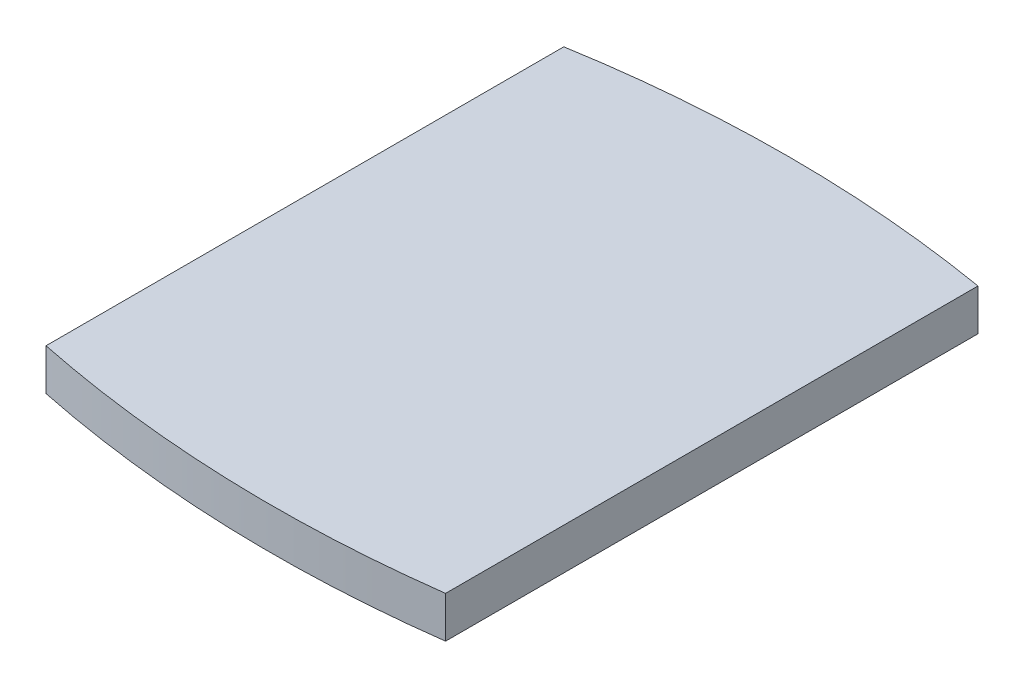
ISO-10303-21;
HEADER;
FILE_DESCRIPTION(('STEP AP214'),'2;1');
FILE_NAME('part.step','',(''),(''),'','','');
FILE_SCHEMA(('AUTOMOTIVE_DESIGN { 1 0 10303 214 1 1 1 1 }'));
ENDSEC;
DATA;
#1=APPLICATION_CONTEXT('core data for automotive mechanical design processes');
#2=APPLICATION_PROTOCOL_DEFINITION('international standard','automotive_design',2000,#1);
#3=PRODUCT_CONTEXT('',#1,'mechanical');
#4=PRODUCT('Part','Part','',(#3));
#5=PRODUCT_RELATED_PRODUCT_CATEGORY('part','',(#4));
#6=PRODUCT_DEFINITION_FORMATION('','',#4);
#7=PRODUCT_DEFINITION_CONTEXT('part definition',#1,'design');
#8=PRODUCT_DEFINITION('design','',#6,#7);
#9=PRODUCT_DEFINITION_SHAPE('','',#8);
#10=(LENGTH_UNIT() NAMED_UNIT(*) SI_UNIT(.MILLI.,.METRE.));
#11=(NAMED_UNIT(*) PLANE_ANGLE_UNIT() SI_UNIT($,.RADIAN.));
#12=(NAMED_UNIT(*) SI_UNIT($,.STERADIAN.) SOLID_ANGLE_UNIT());
#13=UNCERTAINTY_MEASURE_WITH_UNIT(LENGTH_MEASURE(1.E-05),#10,'distance_accuracy_value','');
#14=(GEOMETRIC_REPRESENTATION_CONTEXT(3) GLOBAL_UNCERTAINTY_ASSIGNED_CONTEXT((#13)) GLOBAL_UNIT_ASSIGNED_CONTEXT((#10,
#11,#12)) REPRESENTATION_CONTEXT('',''));
#15=CARTESIAN_POINT('',(0.,0.,0.));
#16=DIRECTION('',(0.,0.,1.));
#17=DIRECTION('',(1.,0.,0.));
#18=AXIS2_PLACEMENT_3D('',#15,#16,#17);
#19=CARTESIAN_POINT('',(12.0899913600632,2.,-58.7693126462578));
#20=DIRECTION('',(0.,-1.,0.));
#21=DIRECTION('',(0.,0.,-1.));
#22=AXIS2_PLACEMENT_3D('',#19,#20,#21);
#23=CYLINDRICAL_SURFACE('',#22,60.);
#24=CARTESIAN_POINT('',(12.0899913600632,0.,-58.7693126462578));
#25=DIRECTION('',(0.,1.,0.));
#26=DIRECTION('',(0.,0.,1.));
#27=AXIS2_PLACEMENT_3D('',#24,#25,#26);
#28=CIRCLE('',#27,60.);
#29=CARTESIAN_POINT('',(0.,0.,0.));
#30=VERTEX_POINT('',#29);
#31=CARTESIAN_POINT('',(20.,0.,0.706999977476057));
#32=VERTEX_POINT('',#31);
#33=EDGE_CURVE('E98',#30,#32,#28,.T.);
#34=ORIENTED_EDGE('',*,*,#33,.T.);
#35=DIRECTION('',(0.,-1.,0.));
#36=VECTOR('',#35,1.);
#37=CARTESIAN_POINT('',(20.,2.,0.706999977476057));
#38=LINE('',#37,#36);
#39=CARTESIAN_POINT('',(20.,2.,0.706999977476057));
#40=VERTEX_POINT('',#39);
#41=EDGE_CURVE('E11',#40,#32,#38,.T.);
#42=ORIENTED_EDGE('',*,*,#41,.F.);
#43=CARTESIAN_POINT('',(12.0899913600632,2.,-58.7693126462578));
#44=DIRECTION('',(0.,1.,0.));
#45=DIRECTION('',(0.,0.,1.));
#46=AXIS2_PLACEMENT_3D('',#43,#44,#45);
#47=CIRCLE('',#46,60.);
#48=CARTESIAN_POINT('',(0.,2.,0.));
#49=VERTEX_POINT('',#48);
#50=EDGE_CURVE('E86',#49,#40,#47,.T.);
#51=ORIENTED_EDGE('',*,*,#50,.F.);
#52=DIRECTION('',(0.,-1.,0.));
#53=VECTOR('',#52,1.);
#54=CARTESIAN_POINT('',(0.,2.,0.));
#55=LINE('',#54,#53);
#56=EDGE_CURVE('E94',#49,#30,#55,.T.);
#57=ORIENTED_EDGE('',*,*,#56,.T.);
#58=EDGE_LOOP('',(#34,#42,#51,#57));
#59=FACE_BOUND('',#58,.T.);
#60=ADVANCED_FACE('F35',(#59),#23,.T.);
#61=CARTESIAN_POINT('',(20.,2.,-25.));
#62=DIRECTION('',(-1.,0.,0.));
#63=DIRECTION('',(0.,0.,1.));
#64=AXIS2_PLACEMENT_3D('',#61,#62,#63);
#65=PLANE('',#64);
#66=DIRECTION('',(0.,0.,-1.));
#67=VECTOR('',#66,1.);
#68=CARTESIAN_POINT('',(20.,0.,-25.));
#69=LINE('',#68,#67);
#70=CARTESIAN_POINT('',(20.,0.,-25.));
#71=VERTEX_POINT('',#70);
#72=EDGE_CURVE('E90',#32,#71,#69,.T.);
#73=ORIENTED_EDGE('',*,*,#72,.T.);
#74=DIRECTION('',(0.,-1.,0.));
#75=VECTOR('',#74,1.);
#76=CARTESIAN_POINT('',(20.,2.,-25.));
#77=LINE('',#76,#75);
#78=CARTESIAN_POINT('',(20.,2.,-25.));
#79=VERTEX_POINT('',#78);
#80=EDGE_CURVE('E43',#79,#71,#77,.T.);
#81=ORIENTED_EDGE('',*,*,#80,.F.);
#82=DIRECTION('',(0.,0.,-1.));
#83=VECTOR('',#82,1.);
#84=CARTESIAN_POINT('',(20.,2.,-25.));
#85=LINE('',#84,#83);
#86=EDGE_CURVE('E81',#40,#79,#85,.T.);
#87=ORIENTED_EDGE('',*,*,#86,.F.);
#88=ORIENTED_EDGE('',*,*,#41,.T.);
#89=EDGE_LOOP('',(#73,#81,#87,#88));
#90=FACE_BOUND('',#89,.T.);
#91=ADVANCED_FACE('F89',(#90),#65,.F.);
#92=CARTESIAN_POINT('',(10.,2.,34.1607978309962));
#93=DIRECTION('',(0.,-1.,0.));
#94=DIRECTION('',(0.,0.,-1.));
#95=AXIS2_PLACEMENT_3D('',#92,#93,#94);
#96=CYLINDRICAL_SURFACE('',#95,60.);
#97=CARTESIAN_POINT('',(10.,0.,34.1607978309962));
#98=DIRECTION('',(0.,1.,0.));
#99=DIRECTION('',(0.,0.,-1.));
#100=AXIS2_PLACEMENT_3D('',#97,#98,#99);
#101=CIRCLE('',#100,60.);
#102=CARTESIAN_POINT('',(0.,0.,-25.));
#103=VERTEX_POINT('',#102);
#104=EDGE_CURVE('E68',#71,#103,#101,.T.);
#105=ORIENTED_EDGE('',*,*,#104,.T.);
#106=DIRECTION('',(0.,-1.,0.));
#107=VECTOR('',#106,1.);
#108=CARTESIAN_POINT('',(0.,2.,-25.));
#109=LINE('',#108,#107);
#110=CARTESIAN_POINT('',(0.,2.,-25.));
#111=VERTEX_POINT('',#110);
#112=EDGE_CURVE('E91',#111,#103,#109,.T.);
#113=ORIENTED_EDGE('',*,*,#112,.F.);
#114=CARTESIAN_POINT('',(10.,2.,34.1607978309962));
#115=DIRECTION('',(0.,1.,0.));
#116=DIRECTION('',(0.,0.,-1.));
#117=AXIS2_PLACEMENT_3D('',#114,#115,#116);
#118=CIRCLE('',#117,60.);
#119=EDGE_CURVE('E84',#79,#111,#118,.T.);
#120=ORIENTED_EDGE('',*,*,#119,.F.);
#121=ORIENTED_EDGE('',*,*,#80,.T.);
#122=EDGE_LOOP('',(#105,#113,#120,#121));
#123=FACE_BOUND('',#122,.T.);
#124=ADVANCED_FACE('F92',(#123),#96,.T.);
#125=CARTESIAN_POINT('',(0.,2.,0.));
#126=DIRECTION('',(1.,0.,0.));
#127=DIRECTION('',(0.,0.,-1.));
#128=AXIS2_PLACEMENT_3D('',#125,#126,#127);
#129=PLANE('',#128);
#130=DIRECTION('',(0.,0.,1.));
#131=VECTOR('',#130,1.);
#132=CARTESIAN_POINT('',(0.,0.,0.));
#133=LINE('',#132,#131);
#134=EDGE_CURVE('E74',#103,#30,#133,.T.);
#135=ORIENTED_EDGE('',*,*,#134,.T.);
#136=ORIENTED_EDGE('',*,*,#56,.F.);
#137=DIRECTION('',(0.,0.,1.));
#138=VECTOR('',#137,1.);
#139=CARTESIAN_POINT('',(0.,2.,0.));
#140=LINE('',#139,#138);
#141=EDGE_CURVE('E51',#111,#49,#140,.T.);
#142=ORIENTED_EDGE('',*,*,#141,.F.);
#143=ORIENTED_EDGE('',*,*,#112,.T.);
#144=EDGE_LOOP('',(#135,#136,#142,#143));
#145=FACE_BOUND('',#144,.T.);
#146=ADVANCED_FACE('F105',(#145),#129,.F.);
#147=CARTESIAN_POINT('',(12.0899913600632,2.,-58.7693126462578));
#148=DIRECTION('',(0.,1.,0.));
#149=DIRECTION('',(0.,0.,1.));
#150=AXIS2_PLACEMENT_3D('',#147,#148,#149);
#151=PLANE('',#150);
#152=ORIENTED_EDGE('',*,*,#50,.T.);
#153=ORIENTED_EDGE('',*,*,#86,.T.);
#154=ORIENTED_EDGE('',*,*,#119,.T.);
#155=ORIENTED_EDGE('',*,*,#141,.T.);
#156=EDGE_LOOP('',(#152,#153,#154,#155));
#157=FACE_BOUND('',#156,.T.);
#158=ADVANCED_FACE('F82',(#157),#151,.T.);
#159=CARTESIAN_POINT('',(12.0899913600632,0.,-58.7693126462578));
#160=DIRECTION('',(0.,1.,0.));
#161=DIRECTION('',(0.,0.,1.));
#162=AXIS2_PLACEMENT_3D('',#159,#160,#161);
#163=PLANE('',#162);
#164=ORIENTED_EDGE('',*,*,#33,.F.);
#165=ORIENTED_EDGE('',*,*,#134,.F.);
#166=ORIENTED_EDGE('',*,*,#104,.F.);
#167=ORIENTED_EDGE('',*,*,#72,.F.);
#168=EDGE_LOOP('',(#164,#165,#166,#167));
#169=FACE_BOUND('',#168,.T.);
#170=ADVANCED_FACE('F108',(#169),#163,.F.);
#171=CLOSED_SHELL('',(#60,#91,#124,#146,#158,#170));
#172=MANIFOLD_SOLID_BREP('B2',#171);
#173=ADVANCED_BREP_SHAPE_REPRESENTATION('',(#18,#172),#14);
#174=SHAPE_DEFINITION_REPRESENTATION(#9,#173);
ENDSEC;
END-ISO-10303-21;
